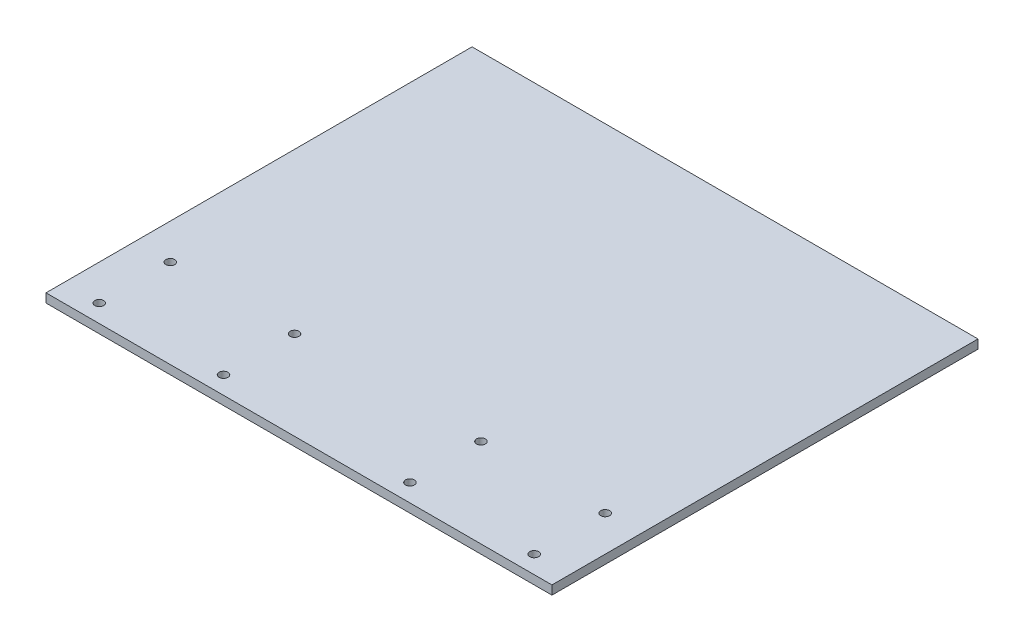
ISO-10303-21;
HEADER;
FILE_DESCRIPTION(('STEP AP214'),'2;1');
FILE_NAME('part.step','',(''),(''),'','','');
FILE_SCHEMA(('AUTOMOTIVE_DESIGN { 1 0 10303 214 1 1 1 1 }'));
ENDSEC;
DATA;
#1=APPLICATION_CONTEXT('core data for automotive mechanical design processes');
#2=APPLICATION_PROTOCOL_DEFINITION('international standard','automotive_design',2000,#1);
#3=PRODUCT_CONTEXT('',#1,'mechanical');
#4=PRODUCT('Part','Part','',(#3));
#5=PRODUCT_RELATED_PRODUCT_CATEGORY('part','',(#4));
#6=PRODUCT_DEFINITION_FORMATION('','',#4);
#7=PRODUCT_DEFINITION_CONTEXT('part definition',#1,'design');
#8=PRODUCT_DEFINITION('design','',#6,#7);
#9=PRODUCT_DEFINITION_SHAPE('','',#8);
#10=(LENGTH_UNIT() NAMED_UNIT(*) SI_UNIT(.MILLI.,.METRE.));
#11=(NAMED_UNIT(*) PLANE_ANGLE_UNIT() SI_UNIT($,.RADIAN.));
#12=(NAMED_UNIT(*) SI_UNIT($,.STERADIAN.) SOLID_ANGLE_UNIT());
#13=UNCERTAINTY_MEASURE_WITH_UNIT(LENGTH_MEASURE(1.E-05),#10,'distance_accuracy_value','');
#14=(GEOMETRIC_REPRESENTATION_CONTEXT(3) GLOBAL_UNCERTAINTY_ASSIGNED_CONTEXT((#13)) GLOBAL_UNIT_ASSIGNED_CONTEXT((#10,
#11,#12)) REPRESENTATION_CONTEXT('',''));
#15=CARTESIAN_POINT('',(0.,0.,0.));
#16=DIRECTION('',(0.,0.,1.));
#17=DIRECTION('',(1.,0.,0.));
#18=AXIS2_PLACEMENT_3D('',#15,#16,#17);
#19=CARTESIAN_POINT('',(-295.598856053384,12.7,-609.6));
#20=DIRECTION('',(1.,0.,0.));
#21=DIRECTION('',(0.,0.,-1.));
#22=AXIS2_PLACEMENT_3D('',#19,#20,#21);
#23=PLANE('',#22);
#24=DIRECTION('',(0.,0.,1.));
#25=VECTOR('',#24,1.);
#26=CARTESIAN_POINT('',(-295.598856053384,0.,-609.6));
#27=LINE('',#26,#25);
#28=CARTESIAN_POINT('',(-295.598856053384,0.,-609.6));
#29=VERTEX_POINT('',#28);
#30=CARTESIAN_POINT('',(-295.598856053384,0.,0.));
#31=VERTEX_POINT('',#30);
#32=EDGE_CURVE('E99',#29,#31,#27,.T.);
#33=ORIENTED_EDGE('',*,*,#32,.T.);
#34=DIRECTION('',(0.,-1.,0.));
#35=VECTOR('',#34,1.);
#36=CARTESIAN_POINT('',(-295.598856053384,12.7,0.));
#37=LINE('',#36,#35);
#38=CARTESIAN_POINT('',(-295.598856053384,12.7,0.));
#39=VERTEX_POINT('',#38);
#40=EDGE_CURVE('E11',#39,#31,#37,.T.);
#41=ORIENTED_EDGE('',*,*,#40,.F.);
#42=DIRECTION('',(0.,0.,1.));
#43=VECTOR('',#42,1.);
#44=CARTESIAN_POINT('',(-295.598856053384,12.7,-609.6));
#45=LINE('',#44,#43);
#46=CARTESIAN_POINT('',(-295.598856053384,12.7,-609.6));
#47=VERTEX_POINT('',#46);
#48=EDGE_CURVE('E87',#47,#39,#45,.T.);
#49=ORIENTED_EDGE('',*,*,#48,.F.);
#50=DIRECTION('',(0.,-1.,0.));
#51=VECTOR('',#50,1.);
#52=CARTESIAN_POINT('',(-295.598856053384,12.7,-609.6));
#53=LINE('',#52,#51);
#54=EDGE_CURVE('E95',#47,#29,#53,.T.);
#55=ORIENTED_EDGE('',*,*,#54,.T.);
#56=EDGE_LOOP('',(#33,#41,#49,#55));
#57=FACE_BOUND('',#56,.T.);
#58=ADVANCED_FACE('F36',(#57),#23,.F.);
#59=CARTESIAN_POINT('',(-295.598856053384,12.7,0.));
#60=DIRECTION('',(0.,0.,-1.));
#61=DIRECTION('',(-1.,0.,0.));
#62=AXIS2_PLACEMENT_3D('',#59,#60,#61);
#63=PLANE('',#62);
#64=DIRECTION('',(1.,0.,0.));
#65=VECTOR('',#64,1.);
#66=CARTESIAN_POINT('',(-295.598856053384,0.,0.));
#67=LINE('',#66,#65);
#68=CARTESIAN_POINT('',(428.301143946616,0.,0.));
#69=VERTEX_POINT('',#68);
#70=EDGE_CURVE('E91',#31,#69,#67,.T.);
#71=ORIENTED_EDGE('',*,*,#70,.T.);
#72=DIRECTION('',(0.,-1.,0.));
#73=VECTOR('',#72,1.);
#74=CARTESIAN_POINT('',(428.301143946616,12.7,0.));
#75=LINE('',#74,#73);
#76=CARTESIAN_POINT('',(428.301143946616,12.7,0.));
#77=VERTEX_POINT('',#76);
#78=EDGE_CURVE('E44',#77,#69,#75,.T.);
#79=ORIENTED_EDGE('',*,*,#78,.F.);
#80=DIRECTION('',(1.,0.,0.));
#81=VECTOR('',#80,1.);
#82=CARTESIAN_POINT('',(-295.598856053384,12.7,0.));
#83=LINE('',#82,#81);
#84=EDGE_CURVE('E82',#39,#77,#83,.T.);
#85=ORIENTED_EDGE('',*,*,#84,.F.);
#86=ORIENTED_EDGE('',*,*,#40,.T.);
#87=EDGE_LOOP('',(#71,#79,#85,#86));
#88=FACE_BOUND('',#87,.T.);
#89=ADVANCED_FACE('F90',(#88),#63,.F.);
#90=CARTESIAN_POINT('',(428.301143946616,12.7,-609.6));
#91=DIRECTION('',(-1.,0.,0.));
#92=DIRECTION('',(0.,0.,1.));
#93=AXIS2_PLACEMENT_3D('',#90,#91,#92);
#94=PLANE('',#93);
#95=DIRECTION('',(0.,0.,-1.));
#96=VECTOR('',#95,1.);
#97=CARTESIAN_POINT('',(428.301143946616,0.,-609.6));
#98=LINE('',#97,#96);
#99=CARTESIAN_POINT('',(428.301143946616,0.,-609.6));
#100=VERTEX_POINT('',#99);
#101=EDGE_CURVE('E69',#69,#100,#98,.T.);
#102=ORIENTED_EDGE('',*,*,#101,.T.);
#103=DIRECTION('',(0.,-1.,0.));
#104=VECTOR('',#103,1.);
#105=CARTESIAN_POINT('',(428.301143946616,12.7,-609.6));
#106=LINE('',#105,#104);
#107=CARTESIAN_POINT('',(428.301143946616,12.7,-609.6));
#108=VERTEX_POINT('',#107);
#109=EDGE_CURVE('E92',#108,#100,#106,.T.);
#110=ORIENTED_EDGE('',*,*,#109,.F.);
#111=DIRECTION('',(0.,0.,-1.));
#112=VECTOR('',#111,1.);
#113=CARTESIAN_POINT('',(428.301143946616,12.7,-609.6));
#114=LINE('',#113,#112);
#115=EDGE_CURVE('E85',#77,#108,#114,.T.);
#116=ORIENTED_EDGE('',*,*,#115,.F.);
#117=ORIENTED_EDGE('',*,*,#78,.T.);
#118=EDGE_LOOP('',(#102,#110,#116,#117));
#119=FACE_BOUND('',#118,.T.);
#120=ADVANCED_FACE('F93',(#119),#94,.F.);
#121=CARTESIAN_POINT('',(-295.598856053384,12.7,-609.6));
#122=DIRECTION('',(0.,0.,1.));
#123=DIRECTION('',(1.,0.,0.));
#124=AXIS2_PLACEMENT_3D('',#121,#122,#123);
#125=PLANE('',#124);
#126=DIRECTION('',(-1.,0.,0.));
#127=VECTOR('',#126,1.);
#128=CARTESIAN_POINT('',(-295.598856053384,0.,-609.6));
#129=LINE('',#128,#127);
#130=EDGE_CURVE('E75',#100,#29,#129,.T.);
#131=ORIENTED_EDGE('',*,*,#130,.T.);
#132=ORIENTED_EDGE('',*,*,#54,.F.);
#133=DIRECTION('',(-1.,0.,0.));
#134=VECTOR('',#133,1.);
#135=CARTESIAN_POINT('',(-295.598856053384,12.7,-609.6));
#136=LINE('',#135,#134);
#137=EDGE_CURVE('E52',#108,#47,#136,.T.);
#138=ORIENTED_EDGE('',*,*,#137,.F.);
#139=ORIENTED_EDGE('',*,*,#109,.T.);
#140=EDGE_LOOP('',(#131,#132,#138,#139));
#141=FACE_BOUND('',#140,.T.);
#142=ADVANCED_FACE('F107',(#141),#125,.F.);
#143=CARTESIAN_POINT('',(0.,12.7,0.));
#144=DIRECTION('',(0.,1.,0.));
#145=DIRECTION('',(0.,0.,1.));
#146=AXIS2_PLACEMENT_3D('',#143,#144,#145);
#147=PLANE('',#146);
#148=CARTESIAN_POINT('',(-244.798856053384,12.7,-127.));
#149=DIRECTION('',(0.,1.,0.));
#150=DIRECTION('',(0.,0.,-1.));
#151=AXIS2_PLACEMENT_3D('',#148,#149,#150);
#152=CIRCLE('',#151,6.34999999999994);
#153=CARTESIAN_POINT('',(-244.798856053384,12.7,-133.35));
#154=VERTEX_POINT('',#153);
#155=EDGE_CURVE('E131',#154,#154,#152,.T.);
#156=ORIENTED_EDGE('',*,*,#155,.F.);
#157=EDGE_LOOP('',(#156));
#158=FACE_BOUND('',#157,.T.);
#159=CARTESIAN_POINT('',(199.701143946616,12.7,-25.4));
#160=DIRECTION('',(0.,1.,0.));
#161=DIRECTION('',(0.,0.,1.));
#162=AXIS2_PLACEMENT_3D('',#159,#160,#161);
#163=CIRCLE('',#162,6.35);
#164=CARTESIAN_POINT('',(199.701143946616,12.7,-19.05));
#165=VERTEX_POINT('',#164);
#166=EDGE_CURVE('E138',#165,#165,#163,.T.);
#167=ORIENTED_EDGE('',*,*,#166,.F.);
#168=EDGE_LOOP('',(#167));
#169=FACE_BOUND('',#168,.T.);
#170=CARTESIAN_POINT('',(199.701143946616,12.7,-127.));
#171=DIRECTION('',(0.,1.,0.));
#172=DIRECTION('',(0.,0.,1.));
#173=AXIS2_PLACEMENT_3D('',#170,#171,#172);
#174=CIRCLE('',#173,6.34999999999994);
#175=CARTESIAN_POINT('',(199.701143946616,12.7,-120.65));
#176=VERTEX_POINT('',#175);
#177=EDGE_CURVE('E119',#176,#176,#174,.T.);
#178=ORIENTED_EDGE('',*,*,#177,.F.);
#179=EDGE_LOOP('',(#178));
#180=FACE_BOUND('',#179,.T.);
#181=CARTESIAN_POINT('',(377.501143946616,12.7,-25.4));
#182=DIRECTION('',(0.,1.,0.));
#183=DIRECTION('',(0.,0.,1.));
#184=AXIS2_PLACEMENT_3D('',#181,#182,#183);
#185=CIRCLE('',#184,6.35);
#186=CARTESIAN_POINT('',(377.501143946616,12.7,-19.05));
#187=VERTEX_POINT('',#186);
#188=EDGE_CURVE('E126',#187,#187,#185,.T.);
#189=ORIENTED_EDGE('',*,*,#188,.F.);
#190=EDGE_LOOP('',(#189));
#191=FACE_BOUND('',#190,.T.);
#192=CARTESIAN_POINT('',(-66.9988560533842,12.7,-25.4));
#193=DIRECTION('',(0.,1.,0.));
#194=DIRECTION('',(0.,0.,-1.));
#195=AXIS2_PLACEMENT_3D('',#192,#193,#194);
#196=CIRCLE('',#195,6.35);
#197=CARTESIAN_POINT('',(-66.9988560533842,12.7,-31.75));
#198=VERTEX_POINT('',#197);
#199=EDGE_CURVE('E155',#198,#198,#196,.T.);
#200=ORIENTED_EDGE('',*,*,#199,.F.);
#201=EDGE_LOOP('',(#200));
#202=FACE_BOUND('',#201,.T.);
#203=CARTESIAN_POINT('',(-244.798856053384,12.7,-25.3999999999999));
#204=DIRECTION('',(0.,1.,0.));
#205=DIRECTION('',(0.,0.,-1.));
#206=AXIS2_PLACEMENT_3D('',#203,#204,#205);
#207=CIRCLE('',#206,6.35);
#208=CARTESIAN_POINT('',(-244.798856053384,12.7,-31.7499999999999));
#209=VERTEX_POINT('',#208);
#210=EDGE_CURVE('E143',#209,#209,#207,.T.);
#211=ORIENTED_EDGE('',*,*,#210,.F.);
#212=EDGE_LOOP('',(#211));
#213=FACE_BOUND('',#212,.T.);
#214=CARTESIAN_POINT('',(-66.9988560533842,12.7,-127.));
#215=DIRECTION('',(0.,1.,0.));
#216=DIRECTION('',(0.,0.,-1.));
#217=AXIS2_PLACEMENT_3D('',#214,#215,#216);
#218=CIRCLE('',#217,6.34999999999995);
#219=CARTESIAN_POINT('',(-66.9988560533842,12.7,-133.35));
#220=VERTEX_POINT('',#219);
#221=EDGE_CURVE('E150',#220,#220,#218,.T.);
#222=ORIENTED_EDGE('',*,*,#221,.F.);
#223=EDGE_LOOP('',(#222));
#224=FACE_BOUND('',#223,.T.);
#225=CARTESIAN_POINT('',(377.501143946616,12.7,-127.));
#226=DIRECTION('',(0.,1.,0.));
#227=DIRECTION('',(0.,0.,1.));
#228=AXIS2_PLACEMENT_3D('',#225,#226,#227);
#229=CIRCLE('',#228,6.34999999999999);
#230=CARTESIAN_POINT('',(377.501143946616,12.7,-120.65));
#231=VERTEX_POINT('',#230);
#232=EDGE_CURVE('E113',#231,#231,#229,.T.);
#233=ORIENTED_EDGE('',*,*,#232,.F.);
#234=EDGE_LOOP('',(#233));
#235=FACE_BOUND('',#234,.T.);
#236=ORIENTED_EDGE('',*,*,#48,.T.);
#237=ORIENTED_EDGE('',*,*,#84,.T.);
#238=ORIENTED_EDGE('',*,*,#115,.T.);
#239=ORIENTED_EDGE('',*,*,#137,.T.);
#240=EDGE_LOOP('',(#236,#237,#238,#239));
#241=FACE_BOUND('',#240,.T.);
#242=ADVANCED_FACE('F83',(#158,#169,#180,#191,#202,#213,#224,#235,#241),#147,.T.);
#243=CARTESIAN_POINT('',(0.,0.,0.));
#244=DIRECTION('',(0.,1.,0.));
#245=DIRECTION('',(0.,0.,1.));
#246=AXIS2_PLACEMENT_3D('',#243,#244,#245);
#247=PLANE('',#246);
#248=CARTESIAN_POINT('',(-244.798856053384,0.,-127.));
#249=DIRECTION('',(0.,1.,0.));
#250=DIRECTION('',(0.,0.,-1.));
#251=AXIS2_PLACEMENT_3D('',#248,#249,#250);
#252=CIRCLE('',#251,6.34999999999994);
#253=CARTESIAN_POINT('',(-244.798856053384,0.,-133.35));
#254=VERTEX_POINT('',#253);
#255=EDGE_CURVE('E134',#254,#254,#252,.T.);
#256=ORIENTED_EDGE('',*,*,#255,.T.);
#257=EDGE_LOOP('',(#256));
#258=FACE_BOUND('',#257,.T.);
#259=CARTESIAN_POINT('',(199.701143946616,0.,-25.4));
#260=DIRECTION('',(0.,1.,0.));
#261=DIRECTION('',(0.,0.,1.));
#262=AXIS2_PLACEMENT_3D('',#259,#260,#261);
#263=CIRCLE('',#262,6.35);
#264=CARTESIAN_POINT('',(199.701143946616,0.,-19.05));
#265=VERTEX_POINT('',#264);
#266=EDGE_CURVE('E123',#265,#265,#263,.T.);
#267=ORIENTED_EDGE('',*,*,#266,.T.);
#268=EDGE_LOOP('',(#267));
#269=FACE_BOUND('',#268,.T.);
#270=CARTESIAN_POINT('',(199.701143946616,0.,-127.));
#271=DIRECTION('',(0.,1.,0.));
#272=DIRECTION('',(0.,0.,1.));
#273=AXIS2_PLACEMENT_3D('',#270,#271,#272);
#274=CIRCLE('',#273,6.34999999999994);
#275=CARTESIAN_POINT('',(199.701143946616,0.,-120.65));
#276=VERTEX_POINT('',#275);
#277=EDGE_CURVE('E122',#276,#276,#274,.T.);
#278=ORIENTED_EDGE('',*,*,#277,.T.);
#279=EDGE_LOOP('',(#278));
#280=FACE_BOUND('',#279,.T.);
#281=CARTESIAN_POINT('',(377.501143946616,0.,-25.4));
#282=DIRECTION('',(0.,1.,0.));
#283=DIRECTION('',(0.,0.,1.));
#284=AXIS2_PLACEMENT_3D('',#281,#282,#283);
#285=CIRCLE('',#284,6.35);
#286=CARTESIAN_POINT('',(377.501143946616,0.,-19.05));
#287=VERTEX_POINT('',#286);
#288=EDGE_CURVE('E116',#287,#287,#285,.T.);
#289=ORIENTED_EDGE('',*,*,#288,.T.);
#290=EDGE_LOOP('',(#289));
#291=FACE_BOUND('',#290,.T.);
#292=CARTESIAN_POINT('',(-66.9988560533842,0.,-25.4));
#293=DIRECTION('',(0.,1.,0.));
#294=DIRECTION('',(0.,0.,-1.));
#295=AXIS2_PLACEMENT_3D('',#292,#293,#294);
#296=CIRCLE('',#295,6.35);
#297=CARTESIAN_POINT('',(-66.9988560533842,0.,-31.75));
#298=VERTEX_POINT('',#297);
#299=EDGE_CURVE('E147',#298,#298,#296,.T.);
#300=ORIENTED_EDGE('',*,*,#299,.T.);
#301=EDGE_LOOP('',(#300));
#302=FACE_BOUND('',#301,.T.);
#303=CARTESIAN_POINT('',(-244.798856053384,0.,-25.3999999999999));
#304=DIRECTION('',(0.,1.,0.));
#305=DIRECTION('',(0.,0.,-1.));
#306=AXIS2_PLACEMENT_3D('',#303,#304,#305);
#307=CIRCLE('',#306,6.35);
#308=CARTESIAN_POINT('',(-244.798856053384,0.,-31.7499999999999));
#309=VERTEX_POINT('',#308);
#310=EDGE_CURVE('E146',#309,#309,#307,.T.);
#311=ORIENTED_EDGE('',*,*,#310,.T.);
#312=EDGE_LOOP('',(#311));
#313=FACE_BOUND('',#312,.T.);
#314=CARTESIAN_POINT('',(-66.9988560533842,0.,-127.));
#315=DIRECTION('',(0.,1.,0.));
#316=DIRECTION('',(0.,0.,-1.));
#317=AXIS2_PLACEMENT_3D('',#314,#315,#316);
#318=CIRCLE('',#317,6.34999999999995);
#319=CARTESIAN_POINT('',(-66.9988560533842,0.,-133.35));
#320=VERTEX_POINT('',#319);
#321=EDGE_CURVE('E135',#320,#320,#318,.T.);
#322=ORIENTED_EDGE('',*,*,#321,.T.);
#323=EDGE_LOOP('',(#322));
#324=FACE_BOUND('',#323,.T.);
#325=CARTESIAN_POINT('',(377.501143946616,0.,-127.));
#326=DIRECTION('',(0.,1.,0.));
#327=DIRECTION('',(0.,0.,1.));
#328=AXIS2_PLACEMENT_3D('',#325,#326,#327);
#329=CIRCLE('',#328,6.34999999999999);
#330=CARTESIAN_POINT('',(377.501143946616,0.,-120.65));
#331=VERTEX_POINT('',#330);
#332=EDGE_CURVE('E102',#331,#331,#329,.T.);
#333=ORIENTED_EDGE('',*,*,#332,.T.);
#334=EDGE_LOOP('',(#333));
#335=FACE_BOUND('',#334,.T.);
#336=ORIENTED_EDGE('',*,*,#32,.F.);
#337=ORIENTED_EDGE('',*,*,#130,.F.);
#338=ORIENTED_EDGE('',*,*,#101,.F.);
#339=ORIENTED_EDGE('',*,*,#70,.F.);
#340=EDGE_LOOP('',(#336,#337,#338,#339));
#341=FACE_BOUND('',#340,.T.);
#342=ADVANCED_FACE('F110',(#258,#269,#280,#291,#302,#313,#324,#335,#341),#247,.F.);
#343=CARTESIAN_POINT('',(377.501143946616,0.,-127.));
#344=DIRECTION('',(0.,1.,0.));
#345=DIRECTION('',(0.,0.,1.));
#346=AXIS2_PLACEMENT_3D('',#343,#344,#345);
#347=CYLINDRICAL_SURFACE('',#346,6.34999999999999);
#348=ORIENTED_EDGE('',*,*,#332,.F.);
#349=EDGE_LOOP('',(#348));
#350=FACE_BOUND('',#349,.T.);
#351=ORIENTED_EDGE('',*,*,#232,.T.);
#352=EDGE_LOOP('',(#351));
#353=FACE_BOUND('',#352,.T.);
#354=ADVANCED_FACE('F181',(#350,#353),#347,.F.);
#355=CARTESIAN_POINT('',(-66.9988560533842,0.,-127.));
#356=DIRECTION('',(0.,1.,0.));
#357=DIRECTION('',(0.,0.,1.));
#358=AXIS2_PLACEMENT_3D('',#355,#356,#357);
#359=CYLINDRICAL_SURFACE('',#358,6.34999999999995);
#360=ORIENTED_EDGE('',*,*,#321,.F.);
#361=EDGE_LOOP('',(#360));
#362=FACE_BOUND('',#361,.T.);
#363=ORIENTED_EDGE('',*,*,#221,.T.);
#364=EDGE_LOOP('',(#363));
#365=FACE_BOUND('',#364,.T.);
#366=ADVANCED_FACE('F183',(#362,#365),#359,.F.);
#367=CARTESIAN_POINT('',(-244.798856053384,0.,-25.3999999999999));
#368=DIRECTION('',(0.,1.,0.));
#369=DIRECTION('',(0.,0.,1.));
#370=AXIS2_PLACEMENT_3D('',#367,#368,#369);
#371=CYLINDRICAL_SURFACE('',#370,6.35);
#372=ORIENTED_EDGE('',*,*,#310,.F.);
#373=EDGE_LOOP('',(#372));
#374=FACE_BOUND('',#373,.T.);
#375=ORIENTED_EDGE('',*,*,#210,.T.);
#376=EDGE_LOOP('',(#375));
#377=FACE_BOUND('',#376,.T.);
#378=ADVANCED_FACE('F167',(#374,#377),#371,.F.);
#379=CARTESIAN_POINT('',(-66.9988560533842,0.,-25.4));
#380=DIRECTION('',(0.,1.,0.));
#381=DIRECTION('',(0.,0.,1.));
#382=AXIS2_PLACEMENT_3D('',#379,#380,#381);
#383=CYLINDRICAL_SURFACE('',#382,6.35);
#384=ORIENTED_EDGE('',*,*,#299,.F.);
#385=EDGE_LOOP('',(#384));
#386=FACE_BOUND('',#385,.T.);
#387=ORIENTED_EDGE('',*,*,#199,.T.);
#388=EDGE_LOOP('',(#387));
#389=FACE_BOUND('',#388,.T.);
#390=ADVANCED_FACE('F163',(#386,#389),#383,.F.);
#391=CARTESIAN_POINT('',(377.501143946616,0.,-25.4));
#392=DIRECTION('',(0.,1.,0.));
#393=DIRECTION('',(0.,0.,1.));
#394=AXIS2_PLACEMENT_3D('',#391,#392,#393);
#395=CYLINDRICAL_SURFACE('',#394,6.35);
#396=ORIENTED_EDGE('',*,*,#288,.F.);
#397=EDGE_LOOP('',(#396));
#398=FACE_BOUND('',#397,.T.);
#399=ORIENTED_EDGE('',*,*,#188,.T.);
#400=EDGE_LOOP('',(#399));
#401=FACE_BOUND('',#400,.T.);
#402=ADVANCED_FACE('F166',(#398,#401),#395,.F.);
#403=CARTESIAN_POINT('',(199.701143946616,0.,-127.));
#404=DIRECTION('',(0.,1.,0.));
#405=DIRECTION('',(0.,0.,1.));
#406=AXIS2_PLACEMENT_3D('',#403,#404,#405);
#407=CYLINDRICAL_SURFACE('',#406,6.34999999999994);
#408=ORIENTED_EDGE('',*,*,#277,.F.);
#409=EDGE_LOOP('',(#408));
#410=FACE_BOUND('',#409,.T.);
#411=ORIENTED_EDGE('',*,*,#177,.T.);
#412=EDGE_LOOP('',(#411));
#413=FACE_BOUND('',#412,.T.);
#414=ADVANCED_FACE('F252',(#410,#413),#407,.F.);
#415=CARTESIAN_POINT('',(199.701143946616,0.,-25.4));
#416=DIRECTION('',(0.,1.,0.));
#417=DIRECTION('',(0.,0.,1.));
#418=AXIS2_PLACEMENT_3D('',#415,#416,#417);
#419=CYLINDRICAL_SURFACE('',#418,6.35);
#420=ORIENTED_EDGE('',*,*,#266,.F.);
#421=EDGE_LOOP('',(#420));
#422=FACE_BOUND('',#421,.T.);
#423=ORIENTED_EDGE('',*,*,#166,.T.);
#424=EDGE_LOOP('',(#423));
#425=FACE_BOUND('',#424,.T.);
#426=ADVANCED_FACE('F262',(#422,#425),#419,.F.);
#427=CARTESIAN_POINT('',(-244.798856053384,0.,-127.));
#428=DIRECTION('',(0.,1.,0.));
#429=DIRECTION('',(0.,0.,1.));
#430=AXIS2_PLACEMENT_3D('',#427,#428,#429);
#431=CYLINDRICAL_SURFACE('',#430,6.34999999999994);
#432=ORIENTED_EDGE('',*,*,#255,.F.);
#433=EDGE_LOOP('',(#432));
#434=FACE_BOUND('',#433,.T.);
#435=ORIENTED_EDGE('',*,*,#155,.T.);
#436=EDGE_LOOP('',(#435));
#437=FACE_BOUND('',#436,.T.);
#438=ADVANCED_FACE('F271',(#434,#437),#431,.F.);
#439=CLOSED_SHELL('',(#58,#89,#120,#142,#242,#342,#354,#366,#378,#390,#402,#414,#426,#438));
#440=MANIFOLD_SOLID_BREP('B2',#439);
#441=ADVANCED_BREP_SHAPE_REPRESENTATION('',(#18,#440),#14);
#442=SHAPE_DEFINITION_REPRESENTATION(#9,#441);
ENDSEC;
END-ISO-10303-21;
